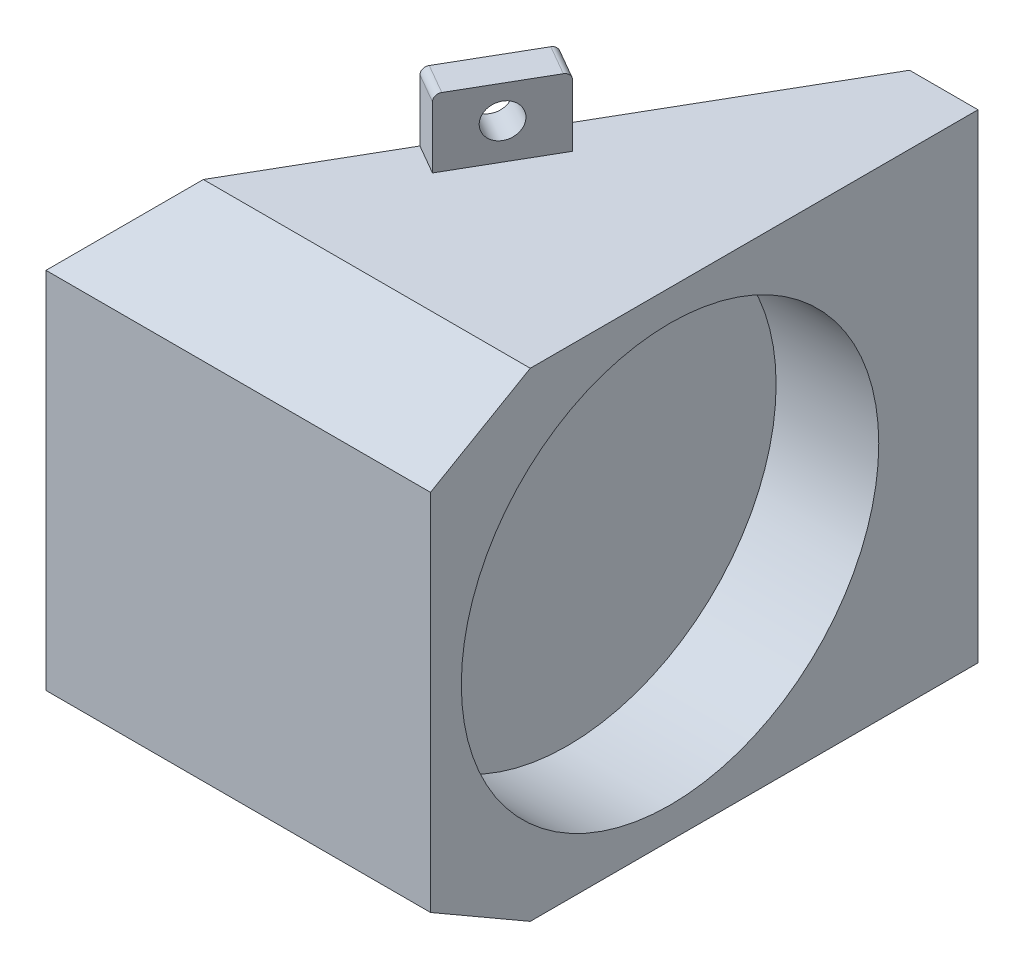
ISO-10303-21;
HEADER;
FILE_DESCRIPTION(('STEP AP214'),'2;1');
FILE_NAME('part.step','',(''),(''),'','','');
FILE_SCHEMA(('AUTOMOTIVE_DESIGN { 1 0 10303 214 1 1 1 1 }'));
ENDSEC;
DATA;
#1=APPLICATION_CONTEXT('core data for automotive mechanical design processes');
#2=APPLICATION_PROTOCOL_DEFINITION('international standard','automotive_design',2000,#1);
#3=PRODUCT_CONTEXT('',#1,'mechanical');
#4=PRODUCT('Part','Part','',(#3));
#5=PRODUCT_RELATED_PRODUCT_CATEGORY('part','',(#4));
#6=PRODUCT_DEFINITION_FORMATION('','',#4);
#7=PRODUCT_DEFINITION_CONTEXT('part definition',#1,'design');
#8=PRODUCT_DEFINITION('design','',#6,#7);
#9=PRODUCT_DEFINITION_SHAPE('','',#8);
#10=(LENGTH_UNIT() NAMED_UNIT(*) SI_UNIT(.MILLI.,.METRE.));
#11=(NAMED_UNIT(*) PLANE_ANGLE_UNIT() SI_UNIT($,.RADIAN.));
#12=(NAMED_UNIT(*) SI_UNIT($,.STERADIAN.) SOLID_ANGLE_UNIT());
#13=UNCERTAINTY_MEASURE_WITH_UNIT(LENGTH_MEASURE(1.E-05),#10,'distance_accuracy_value','');
#14=(GEOMETRIC_REPRESENTATION_CONTEXT(3) GLOBAL_UNCERTAINTY_ASSIGNED_CONTEXT((#13)) GLOBAL_UNIT_ASSIGNED_CONTEXT((#10,
#11,#12)) REPRESENTATION_CONTEXT('',''));
#15=CARTESIAN_POINT('',(0.,0.,0.));
#16=DIRECTION('',(0.,0.,1.));
#17=DIRECTION('',(1.,0.,0.));
#18=AXIS2_PLACEMENT_3D('',#15,#16,#17);
#19=CARTESIAN_POINT('',(0.,0.,0.));
#20=DIRECTION('',(0.,1.,0.));
#21=DIRECTION('',(0.,0.,1.));
#22=AXIS2_PLACEMENT_3D('',#19,#20,#21);
#23=PLANE('',#22);
#24=DIRECTION('',(0.,0.,-1.));
#25=VECTOR('',#24,1.);
#26=CARTESIAN_POINT('',(12.7,0.,0.));
#27=LINE('',#26,#25);
#28=CARTESIAN_POINT('',(12.7,0.,-18.5091607941304));
#29=VERTEX_POINT('',#28);
#30=CARTESIAN_POINT('',(12.7,0.,-101.6));
#31=VERTEX_POINT('',#30);
#32=EDGE_CURVE('E273',#29,#31,#27,.T.);
#33=ORIENTED_EDGE('',*,*,#32,.F.);
#34=DIRECTION('',(1.,0.,0.));
#35=VECTOR('',#34,1.);
#36=CARTESIAN_POINT('',(-58.6587873496651,0.,-18.5091607941304));
#37=LINE('',#36,#35);
#38=CARTESIAN_POINT('',(-47.9725183827,0.,-18.5091607941304));
#39=VERTEX_POINT('',#38);
#40=EDGE_CURVE('E398',#39,#29,#37,.T.);
#41=ORIENTED_EDGE('',*,*,#40,.F.);
#42=DIRECTION('',(-0.499999999999995,0.,0.866025403784442));
#43=VECTOR('',#42,1.);
#44=CARTESIAN_POINT('',(0.,0.,-101.6));
#45=LINE('',#44,#43);
#46=CARTESIAN_POINT('',(-32.7225854253355,0.,-44.9228194883053));
#47=VERTEX_POINT('',#46);
#48=EDGE_CURVE('E288',#47,#39,#45,.T.);
#49=ORIENTED_EDGE('',*,*,#48,.F.);
#50=DIRECTION('',(-0.866025403784439,0.,-0.5));
#51=VECTOR('',#50,1.);
#52=CARTESIAN_POINT('',(-32.7225854253355,0.,-44.9228194883053));
#53=LINE('',#52,#51);
#54=CARTESIAN_POINT('',(-27.2233241113047,0.,-41.7478194883055));
#55=VERTEX_POINT('',#54);
#56=EDGE_CURVE('E251',#55,#47,#53,.T.);
#57=ORIENTED_EDGE('',*,*,#56,.F.);
#58=DIRECTION('',(-0.5,0.,0.866025403784438));
#59=VECTOR('',#58,1.);
#60=CARTESIAN_POINT('',(-27.2233241113047,0.,-41.7478194883055));
#61=LINE('',#60,#59);
#62=CARTESIAN_POINT('',(-17.6983241113047,0.,-58.245603430399));
#63=VERTEX_POINT('',#62);
#64=EDGE_CURVE('E255',#63,#55,#61,.T.);
#65=ORIENTED_EDGE('',*,*,#64,.F.);
#66=DIRECTION('',(0.86602540378444,0.,0.499999999999998));
#67=VECTOR('',#66,1.);
#68=CARTESIAN_POINT('',(-17.6983241113047,0.,-58.245603430399));
#69=LINE('',#68,#67);
#70=CARTESIAN_POINT('',(-23.1975854253356,0.,-61.4206034303989));
#71=VERTEX_POINT('',#70);
#72=EDGE_CURVE('E261',#71,#63,#69,.T.);
#73=ORIENTED_EDGE('',*,*,#72,.F.);
#74=CARTESIAN_POINT('',(0.,0.,-101.6));
#75=VERTEX_POINT('',#74);
#76=EDGE_CURVE('E186',#75,#71,#45,.T.);
#77=ORIENTED_EDGE('',*,*,#76,.F.);
#78=DIRECTION('',(-1.,0.,0.));
#79=VECTOR('',#78,1.);
#80=CARTESIAN_POINT('',(12.7,0.,-101.6));
#81=LINE('',#80,#79);
#82=EDGE_CURVE('E283',#31,#75,#81,.T.);
#83=ORIENTED_EDGE('',*,*,#82,.F.);
#84=EDGE_LOOP('',(#33,#41,#49,#57,#65,#73,#77,#83));
#85=FACE_BOUND('',#84,.T.);
#86=ADVANCED_FACE('F37',(#85),#23,.F.);
#87=CARTESIAN_POINT('',(-6.35,44.45,-44.45));
#88=DIRECTION('',(1.,0.,0.));
#89=DIRECTION('',(0.,0.,-1.));
#90=AXIS2_PLACEMENT_3D('',#87,#88,#89);
#91=CYLINDRICAL_SURFACE('',#90,38.735);
#92=CARTESIAN_POINT('',(-6.35,44.45,-44.45));
#93=DIRECTION('',(1.,0.,0.));
#94=DIRECTION('',(0.,0.,-1.));
#95=AXIS2_PLACEMENT_3D('',#92,#93,#94);
#96=CIRCLE('',#95,38.735);
#97=CARTESIAN_POINT('',(-6.35,44.45,-83.185));
#98=VERTEX_POINT('',#97);
#99=EDGE_CURVE('E286',#98,#98,#96,.T.);
#100=ORIENTED_EDGE('',*,*,#99,.F.);
#101=EDGE_LOOP('',(#100));
#102=FACE_BOUND('',#101,.T.);
#103=CARTESIAN_POINT('',(12.7,44.45,-44.45));
#104=DIRECTION('',(1.,0.,0.));
#105=DIRECTION('',(0.,0.,-1.));
#106=AXIS2_PLACEMENT_3D('',#103,#104,#105);
#107=CIRCLE('',#106,38.735);
#108=CARTESIAN_POINT('',(12.7,44.45,-83.185));
#109=VERTEX_POINT('',#108);
#110=EDGE_CURVE('E269',#109,#109,#107,.T.);
#111=ORIENTED_EDGE('',*,*,#110,.T.);
#112=EDGE_LOOP('',(#111));
#113=FACE_BOUND('',#112,.T.);
#114=ADVANCED_FACE('F359',(#102,#113),#91,.F.);
#115=CARTESIAN_POINT('',(-6.35,44.45,-44.45));
#116=DIRECTION('',(1.,0.,0.));
#117=DIRECTION('',(0.,0.,-1.));
#118=AXIS2_PLACEMENT_3D('',#115,#116,#117);
#119=PLANE('',#118);
#120=ORIENTED_EDGE('',*,*,#99,.T.);
#121=EDGE_LOOP('',(#120));
#122=FACE_BOUND('',#121,.T.);
#123=ADVANCED_FACE('F367',(#122),#119,.T.);
#124=CARTESIAN_POINT('',(12.7,0.,0.));
#125=DIRECTION('',(1.,0.,0.));
#126=DIRECTION('',(0.,0.,-1.));
#127=AXIS2_PLACEMENT_3D('',#124,#125,#126);
#128=PLANE('',#127);
#129=DIRECTION('',(0.,0.499999999999995,-0.866025403784442));
#130=VECTOR('',#129,1.);
#131=CARTESIAN_POINT('',(12.7,88.9,-18.5091607941304));
#132=LINE('',#131,#130);
#133=CARTESIAN_POINT('',(12.7,78.2137310330349,0.));
#134=VERTEX_POINT('',#133);
#135=CARTESIAN_POINT('',(12.7,88.9,-18.5091607941304));
#136=VERTEX_POINT('',#135);
#137=EDGE_CURVE('E173',#134,#136,#132,.T.);
#138=ORIENTED_EDGE('',*,*,#137,.F.);
#139=DIRECTION('',(0.,-1.,0.));
#140=VECTOR('',#139,1.);
#141=CARTESIAN_POINT('',(12.7,88.9,0.));
#142=LINE('',#141,#140);
#143=CARTESIAN_POINT('',(12.7,10.6862689669651,0.));
#144=VERTEX_POINT('',#143);
#145=EDGE_CURVE('E172',#134,#144,#142,.T.);
#146=ORIENTED_EDGE('',*,*,#145,.T.);
#147=DIRECTION('',(0.,0.499999999999995,0.866025403784442));
#148=VECTOR('',#147,1.);
#149=CARTESIAN_POINT('',(12.7,0.,-18.5091607941304));
#150=LINE('',#149,#148);
#151=EDGE_CURVE('E402',#29,#144,#150,.T.);
#152=ORIENTED_EDGE('',*,*,#151,.F.);
#153=ORIENTED_EDGE('',*,*,#32,.T.);
#154=DIRECTION('',(0.,1.,0.));
#155=VECTOR('',#154,1.);
#156=CARTESIAN_POINT('',(12.7,0.,-101.6));
#157=LINE('',#156,#155);
#158=CARTESIAN_POINT('',(12.7,88.9,-101.6));
#159=VERTEX_POINT('',#158);
#160=EDGE_CURVE('E275',#31,#159,#157,.T.);
#161=ORIENTED_EDGE('',*,*,#160,.T.);
#162=DIRECTION('',(0.,0.,1.));
#163=VECTOR('',#162,1.);
#164=CARTESIAN_POINT('',(12.7,88.9,-101.6));
#165=LINE('',#164,#163);
#166=EDGE_CURVE('E277',#159,#136,#165,.T.);
#167=ORIENTED_EDGE('',*,*,#166,.T.);
#168=EDGE_LOOP('',(#138,#146,#152,#153,#161,#167));
#169=FACE_BOUND('',#168,.T.);
#170=ORIENTED_EDGE('',*,*,#110,.F.);
#171=EDGE_LOOP('',(#170));
#172=FACE_BOUND('',#171,.T.);
#173=ADVANCED_FACE('F561',(#169,#172),#128,.T.);
#174=CARTESIAN_POINT('',(12.7,0.,-101.6));
#175=DIRECTION('',(0.,0.,1.));
#176=DIRECTION('',(1.,0.,0.));
#177=AXIS2_PLACEMENT_3D('',#174,#175,#176);
#178=PLANE('',#177);
#179=DIRECTION('',(0.,-1.,0.));
#180=VECTOR('',#179,1.);
#181=CARTESIAN_POINT('',(0.,88.9,-101.6));
#182=LINE('',#181,#180);
#183=CARTESIAN_POINT('',(0.,88.9,-101.6));
#184=VERTEX_POINT('',#183);
#185=EDGE_CURVE('E177',#184,#75,#182,.T.);
#186=ORIENTED_EDGE('',*,*,#185,.F.);
#187=DIRECTION('',(-1.,0.,0.));
#188=VECTOR('',#187,1.);
#189=CARTESIAN_POINT('',(12.7,88.9,-101.6));
#190=LINE('',#189,#188);
#191=EDGE_CURVE('E280',#159,#184,#190,.T.);
#192=ORIENTED_EDGE('',*,*,#191,.F.);
#193=ORIENTED_EDGE('',*,*,#160,.F.);
#194=ORIENTED_EDGE('',*,*,#82,.T.);
#195=EDGE_LOOP('',(#186,#192,#193,#194));
#196=FACE_BOUND('',#195,.T.);
#197=ADVANCED_FACE('F378',(#196),#178,.F.);
#198=CARTESIAN_POINT('',(-58.6587873496651,88.9,0.));
#199=DIRECTION('',(0.,0.,-1.));
#200=DIRECTION('',(-1.,0.,0.));
#201=AXIS2_PLACEMENT_3D('',#198,#199,#200);
#202=PLANE('',#201);
#203=ORIENTED_EDGE('',*,*,#145,.F.);
#204=DIRECTION('',(1.,0.,0.));
#205=VECTOR('',#204,1.);
#206=CARTESIAN_POINT('',(-58.6587873496651,78.2137310330349,0.));
#207=LINE('',#206,#205);
#208=CARTESIAN_POINT('',(-58.6587873496651,78.2137310330349,0.));
#209=VERTEX_POINT('',#208);
#210=EDGE_CURVE('E160',#209,#134,#207,.T.);
#211=ORIENTED_EDGE('',*,*,#210,.F.);
#212=DIRECTION('',(0.,-1.,0.));
#213=VECTOR('',#212,1.);
#214=CARTESIAN_POINT('',(-58.6587873496651,88.9,0.));
#215=LINE('',#214,#213);
#216=CARTESIAN_POINT('',(-58.6587873496651,10.6862689669651,0.));
#217=VERTEX_POINT('',#216);
#218=EDGE_CURVE('E170',#209,#217,#215,.T.);
#219=ORIENTED_EDGE('',*,*,#218,.T.);
#220=DIRECTION('',(1.,0.,0.));
#221=VECTOR('',#220,1.);
#222=CARTESIAN_POINT('',(-58.6587873496651,10.6862689669651,0.));
#223=LINE('',#222,#221);
#224=EDGE_CURVE('E59',#217,#144,#223,.T.);
#225=ORIENTED_EDGE('',*,*,#224,.T.);
#226=EDGE_LOOP('',(#203,#211,#219,#225));
#227=FACE_BOUND('',#226,.T.);
#228=ADVANCED_FACE('F169',(#227),#202,.F.);
#229=CARTESIAN_POINT('',(0.,88.9,0.));
#230=DIRECTION('',(0.,1.,0.));
#231=DIRECTION('',(0.,0.,1.));
#232=AXIS2_PLACEMENT_3D('',#229,#230,#231);
#233=PLANE('',#232);
#234=DIRECTION('',(1.,0.,0.));
#235=VECTOR('',#234,1.);
#236=CARTESIAN_POINT('',(-58.6587873496651,88.9,-18.5091607941304));
#237=LINE('',#236,#235);
#238=CARTESIAN_POINT('',(-47.9725183827,88.9,-18.5091607941304));
#239=VERTEX_POINT('',#238);
#240=EDGE_CURVE('E52',#239,#136,#237,.T.);
#241=ORIENTED_EDGE('',*,*,#240,.T.);
#242=ORIENTED_EDGE('',*,*,#166,.F.);
#243=ORIENTED_EDGE('',*,*,#191,.T.);
#244=DIRECTION('',(-0.499999999999995,0.,0.866025403784442));
#245=VECTOR('',#244,1.);
#246=CARTESIAN_POINT('',(0.,88.9,-101.6));
#247=LINE('',#246,#245);
#248=CARTESIAN_POINT('',(-23.7337873496655,88.9,-60.4918744543433));
#249=VERTEX_POINT('',#248);
#250=EDGE_CURVE('E178',#184,#249,#247,.T.);
#251=ORIENTED_EDGE('',*,*,#250,.T.);
#252=DIRECTION('',(-0.866025403784438,0.,-0.500000000000001));
#253=VECTOR('',#252,1.);
#254=CARTESIAN_POINT('',(-23.7337873496658,88.9,-60.4918744543434));
#255=LINE('',#254,#253);
#256=CARTESIAN_POINT('',(-18.2345260356346,88.9,-57.3168744543434));
#257=VERTEX_POINT('',#256);
#258=EDGE_CURVE('E328',#257,#249,#255,.T.);
#259=ORIENTED_EDGE('',*,*,#258,.F.);
#260=DIRECTION('',(0.5,0.,-0.866025403784439));
#261=VECTOR('',#260,1.);
#262=CARTESIAN_POINT('',(-18.2345260356346,88.9,-57.3168744543434));
#263=LINE('',#262,#261);
#264=CARTESIAN_POINT('',(-27.7595260356346,88.9,-40.8190905122498));
#265=VERTEX_POINT('',#264);
#266=EDGE_CURVE('E333',#265,#257,#263,.T.);
#267=ORIENTED_EDGE('',*,*,#266,.F.);
#268=DIRECTION('',(0.866025403784439,0.,0.499999999999999));
#269=VECTOR('',#268,1.);
#270=CARTESIAN_POINT('',(-27.7595260356346,88.9,-40.8190905122498));
#271=LINE('',#270,#269);
#272=CARTESIAN_POINT('',(-33.2587873496654,88.9,-43.9940905122496));
#273=VERTEX_POINT('',#272);
#274=EDGE_CURVE('E298',#273,#265,#271,.T.);
#275=ORIENTED_EDGE('',*,*,#274,.F.);
#276=EDGE_CURVE('E183',#273,#239,#247,.T.);
#277=ORIENTED_EDGE('',*,*,#276,.T.);
#278=EDGE_LOOP('',(#241,#242,#243,#251,#259,#267,#275,#277));
#279=FACE_BOUND('',#278,.T.);
#280=ADVANCED_FACE('F294',(#279),#233,.T.);
#281=CARTESIAN_POINT('',(0.,88.9,-101.6));
#282=DIRECTION('',(0.866025403784442,0.,0.499999999999995));
#283=DIRECTION('',(0.499999999999995,0.,-0.866025403784442));
#284=AXIS2_PLACEMENT_3D('',#281,#282,#283);
#285=PLANE('',#284);
#286=CARTESIAN_POINT('',(-28.4962873496655,95.5413595918628,-52.2429824832964));
#287=DIRECTION('',(0.866025403784442,0.,0.499999999999995));
#288=DIRECTION('',(0.499999999999995,0.,-0.866025403784442));
#289=AXIS2_PLACEMENT_3D('',#286,#287,#288);
#290=CIRCLE('',#289,3.17499999999999);
#291=CARTESIAN_POINT('',(-26.9087873496655,95.5413595918628,-54.992613140312));
#292=VERTEX_POINT('',#291);
#293=EDGE_CURVE('E334',#292,#292,#290,.T.);
#294=ORIENTED_EDGE('',*,*,#293,.T.);
#295=EDGE_LOOP('',(#294));
#296=FACE_BOUND('',#295,.T.);
#297=CARTESIAN_POINT('',(-27.9600854253356,-6.46367915976498,-53.1717114593521));
#298=DIRECTION('',(0.866025403784442,0.,0.499999999999995));
#299=DIRECTION('',(0.499999999999995,0.,-0.866025403784442));
#300=AXIS2_PLACEMENT_3D('',#297,#298,#299);
#301=CIRCLE('',#300,3.17499999999999);
#302=CARTESIAN_POINT('',(-26.3725854253356,-6.46367915976498,-55.9213421163676));
#303=VERTEX_POINT('',#302);
#304=EDGE_CURVE('E258',#303,#303,#301,.T.);
#305=ORIENTED_EDGE('',*,*,#304,.T.);
#306=EDGE_LOOP('',(#305));
#307=FACE_BOUND('',#306,.T.);
#308=ORIENTED_EDGE('',*,*,#218,.F.);
#309=DIRECTION('',(0.447213595499954,0.447213595499954,-0.774596669241488));
#310=VECTOR('',#309,1.);
#311=CARTESIAN_POINT('',(-9.59450367653985,127.27801470616,-84.9818321588264));
#312=LINE('',#311,#310);
#313=EDGE_CURVE('E11',#209,#239,#312,.T.);
#314=ORIENTED_EDGE('',*,*,#313,.T.);
#315=ORIENTED_EDGE('',*,*,#276,.F.);
#316=DIRECTION('',(0.,-1.,0.));
#317=VECTOR('',#316,1.);
#318=CARTESIAN_POINT('',(-33.2587873496658,101.6,-43.9940905122498));
#319=LINE('',#318,#317);
#320=CARTESIAN_POINT('',(-33.2587873496658,100.33,-43.9940905122498));
#321=VERTEX_POINT('',#320);
#322=EDGE_CURVE('E300',#321,#273,#319,.T.);
#323=ORIENTED_EDGE('',*,*,#322,.F.);
#324=CARTESIAN_POINT('',(-32.6237873496654,100.33,-45.0939427750559));
#325=DIRECTION('',(0.866025403784442,0.,0.499999999999995));
#326=DIRECTION('',(0.499999999999995,0.,-0.866025403784442));
#327=AXIS2_PLACEMENT_3D('',#324,#325,#326);
#328=CIRCLE('',#327,1.27);
#329=CARTESIAN_POINT('',(-32.6237873496658,101.6,-45.0939427750561));
#330=VERTEX_POINT('',#329);
#331=EDGE_CURVE('E205',#321,#330,#328,.F.);
#332=ORIENTED_EDGE('',*,*,#331,.T.);
#333=DIRECTION('',(-0.5,0.,0.866025403784439));
#334=VECTOR('',#333,1.);
#335=CARTESIAN_POINT('',(-33.2587873496658,101.6,-43.9940905122498));
#336=LINE('',#335,#334);
#337=CARTESIAN_POINT('',(-24.3687873496658,101.6,-59.3920221915372));
#338=VERTEX_POINT('',#337);
#339=EDGE_CURVE('E318',#338,#330,#336,.T.);
#340=ORIENTED_EDGE('',*,*,#339,.F.);
#341=CARTESIAN_POINT('',(-24.3687873496655,100.33,-59.392022191537));
#342=DIRECTION('',(0.866025403784442,0.,0.499999999999995));
#343=DIRECTION('',(0.499999999999995,0.,-0.866025403784442));
#344=AXIS2_PLACEMENT_3D('',#341,#342,#343);
#345=CIRCLE('',#344,1.27);
#346=CARTESIAN_POINT('',(-23.7337873496658,100.33,-60.4918744543434));
#347=VERTEX_POINT('',#346);
#348=EDGE_CURVE('E203',#338,#347,#345,.F.);
#349=ORIENTED_EDGE('',*,*,#348,.T.);
#350=DIRECTION('',(0.,-1.,0.));
#351=VECTOR('',#350,1.);
#352=CARTESIAN_POINT('',(-23.7337873496658,101.6,-60.4918744543434));
#353=LINE('',#352,#351);
#354=EDGE_CURVE('E324',#347,#249,#353,.T.);
#355=ORIENTED_EDGE('',*,*,#354,.T.);
#356=ORIENTED_EDGE('',*,*,#250,.F.);
#357=ORIENTED_EDGE('',*,*,#185,.T.);
#358=ORIENTED_EDGE('',*,*,#76,.T.);
#359=DIRECTION('',(0.,1.,0.));
#360=VECTOR('',#359,1.);
#361=CARTESIAN_POINT('',(-23.1975854253359,-12.7,-61.420603430399));
#362=LINE('',#361,#360);
#363=CARTESIAN_POINT('',(-23.1975854253359,-11.43,-61.420603430399));
#364=VERTEX_POINT('',#363);
#365=EDGE_CURVE('E228',#364,#71,#362,.T.);
#366=ORIENTED_EDGE('',*,*,#365,.F.);
#367=CARTESIAN_POINT('',(-23.8325854253356,-11.43,-60.3207511675926));
#368=DIRECTION('',(0.866025403784442,0.,0.499999999999995));
#369=DIRECTION('',(0.499999999999995,0.,-0.866025403784442));
#370=AXIS2_PLACEMENT_3D('',#367,#368,#369);
#371=CIRCLE('',#370,1.27);
#372=CARTESIAN_POINT('',(-23.8325854253358,-12.7,-60.3207511675928));
#373=VERTEX_POINT('',#372);
#374=EDGE_CURVE('E199',#364,#373,#371,.F.);
#375=ORIENTED_EDGE('',*,*,#374,.T.);
#376=DIRECTION('',(0.499999999999982,0.,-0.866025403784449));
#377=VECTOR('',#376,1.);
#378=CARTESIAN_POINT('',(-23.1975854253359,-12.7,-61.420603430399));
#379=LINE('',#378,#377);
#380=CARTESIAN_POINT('',(-32.0875854253355,-12.7,-46.0226717511115));
#381=VERTEX_POINT('',#380);
#382=EDGE_CURVE('E238',#381,#373,#379,.T.);
#383=ORIENTED_EDGE('',*,*,#382,.F.);
#384=CARTESIAN_POINT('',(-32.0875854253355,-11.43,-46.0226717511115));
#385=DIRECTION('',(0.866025403784442,0.,0.499999999999995));
#386=DIRECTION('',(0.499999999999995,0.,-0.866025403784442));
#387=AXIS2_PLACEMENT_3D('',#384,#385,#386);
#388=CIRCLE('',#387,1.27);
#389=CARTESIAN_POINT('',(-32.7225854253355,-11.43,-44.9228194883053));
#390=VERTEX_POINT('',#389);
#391=EDGE_CURVE('E201',#381,#390,#388,.F.);
#392=ORIENTED_EDGE('',*,*,#391,.T.);
#393=DIRECTION('',(0.,1.,0.));
#394=VECTOR('',#393,1.);
#395=CARTESIAN_POINT('',(-32.7225854253355,-12.7,-44.9228194883053));
#396=LINE('',#395,#394);
#397=EDGE_CURVE('E237',#390,#47,#396,.T.);
#398=ORIENTED_EDGE('',*,*,#397,.T.);
#399=ORIENTED_EDGE('',*,*,#48,.T.);
#400=DIRECTION('',(-0.447213595499954,0.447213595499954,0.774596669241488));
#401=VECTOR('',#400,1.);
#402=CARTESIAN_POINT('',(-27.3745036765395,-20.5980147061605,-54.1859688002518));
#403=LINE('',#402,#401);
#404=EDGE_CURVE('E45',#39,#217,#403,.T.);
#405=ORIENTED_EDGE('',*,*,#404,.T.);
#406=EDGE_LOOP('',(#308,#314,#315,#323,#332,#340,#349,#355,#356,#357,#358,#366,#375,#383,#392,
#398,#399,#405));
#407=FACE_BOUND('',#406,.T.);
#408=ADVANCED_FACE('F175',(#296,#307,#407),#285,.F.);
#409=CARTESIAN_POINT('',(-17.6983241113047,-12.7,-58.245603430399));
#410=DIRECTION('',(-0.499999999999998,0.,0.86602540378444));
#411=DIRECTION('',(0.86602540378444,0.,0.499999999999998));
#412=AXIS2_PLACEMENT_3D('',#409,#410,#411);
#413=PLANE('',#412);
#414=DIRECTION('',(0.,1.,0.));
#415=VECTOR('',#414,1.);
#416=CARTESIAN_POINT('',(-17.6983241113047,-12.7,-58.245603430399));
#417=LINE('',#416,#415);
#418=CARTESIAN_POINT('',(-17.6983241113047,-11.43,-58.245603430399));
#419=VERTEX_POINT('',#418);
#420=EDGE_CURVE('E230',#419,#63,#417,.T.);
#421=ORIENTED_EDGE('',*,*,#420,.F.);
#422=DIRECTION('',(0.86602540378444,0.,0.499999999999998));
#423=VECTOR('',#422,1.);
#424=CARTESIAN_POINT('',(-17.6983241113047,-11.43,-58.245603430399));
#425=LINE('',#424,#423);
#426=EDGE_CURVE('E221',#419,#364,#425,.F.);
#427=ORIENTED_EDGE('',*,*,#426,.T.);
#428=ORIENTED_EDGE('',*,*,#365,.T.);
#429=ORIENTED_EDGE('',*,*,#72,.T.);
#430=EDGE_LOOP('',(#421,#427,#428,#429));
#431=FACE_BOUND('',#430,.T.);
#432=ADVANCED_FACE('F226',(#431),#413,.F.);
#433=CARTESIAN_POINT('',(-27.2233241113047,-12.7,-41.7478194883055));
#434=DIRECTION('',(-0.866025403784438,0.,-0.5));
#435=DIRECTION('',(-0.5,0.,0.866025403784438));
#436=AXIS2_PLACEMENT_3D('',#433,#434,#435);
#437=PLANE('',#436);
#438=CARTESIAN_POINT('',(-22.4608241113047,-6.46367915976498,-49.9967114593522));
#439=DIRECTION('',(0.866025403784438,0.,0.5));
#440=DIRECTION('',(0.5,0.,-0.866025403784439));
#441=AXIS2_PLACEMENT_3D('',#438,#439,#440);
#442=CIRCLE('',#441,3.17499999999999);
#443=CARTESIAN_POINT('',(-20.8733241113047,-6.46367915976498,-52.7463421163678));
#444=VERTEX_POINT('',#443);
#445=EDGE_CURVE('E305',#444,#444,#442,.T.);
#446=ORIENTED_EDGE('',*,*,#445,.F.);
#447=EDGE_LOOP('',(#446));
#448=FACE_BOUND('',#447,.T.);
#449=DIRECTION('',(0.,1.,0.));
#450=VECTOR('',#449,1.);
#451=CARTESIAN_POINT('',(-27.2233241113047,-12.7,-41.7478194883055));
#452=LINE('',#451,#450);
#453=CARTESIAN_POINT('',(-27.2233241113047,-11.43,-41.7478194883055));
#454=VERTEX_POINT('',#453);
#455=EDGE_CURVE('E266',#454,#55,#452,.T.);
#456=ORIENTED_EDGE('',*,*,#455,.F.);
#457=CARTESIAN_POINT('',(-26.5883241113047,-11.43,-42.8476717511117));
#458=DIRECTION('',(-0.866025403784438,0.,-0.5));
#459=DIRECTION('',(-0.5,0.,0.866025403784438));
#460=AXIS2_PLACEMENT_3D('',#457,#458,#459);
#461=CIRCLE('',#460,1.27);
#462=CARTESIAN_POINT('',(-26.5883241113047,-12.7,-42.8476717511117));
#463=VERTEX_POINT('',#462);
#464=EDGE_CURVE('E219',#454,#463,#461,.F.);
#465=ORIENTED_EDGE('',*,*,#464,.T.);
#466=DIRECTION('',(-0.5,0.,0.866025403784438));
#467=VECTOR('',#466,1.);
#468=CARTESIAN_POINT('',(-27.2233241113047,-12.7,-41.7478194883055));
#469=LINE('',#468,#467);
#470=CARTESIAN_POINT('',(-18.3333241113047,-12.7,-57.1457511675928));
#471=VERTEX_POINT('',#470);
#472=EDGE_CURVE('E245',#471,#463,#469,.T.);
#473=ORIENTED_EDGE('',*,*,#472,.F.);
#474=CARTESIAN_POINT('',(-18.3333241113047,-11.43,-57.1457511675928));
#475=DIRECTION('',(-0.866025403784438,0.,-0.5));
#476=DIRECTION('',(-0.5,0.,0.866025403784438));
#477=AXIS2_PLACEMENT_3D('',#474,#475,#476);
#478=CIRCLE('',#477,1.27);
#479=EDGE_CURVE('E217',#471,#419,#478,.F.);
#480=ORIENTED_EDGE('',*,*,#479,.T.);
#481=ORIENTED_EDGE('',*,*,#420,.T.);
#482=ORIENTED_EDGE('',*,*,#64,.T.);
#483=EDGE_LOOP('',(#456,#465,#473,#480,#481,#482));
#484=FACE_BOUND('',#483,.T.);
#485=ADVANCED_FACE('F249',(#448,#484),#437,.F.);
#486=CARTESIAN_POINT('',(-32.7225854253355,-12.7,-44.9228194883053));
#487=DIRECTION('',(0.5,0.,-0.866025403784438));
#488=DIRECTION('',(-0.866025403784439,0.,-0.5));
#489=AXIS2_PLACEMENT_3D('',#486,#487,#488);
#490=PLANE('',#489);
#491=ORIENTED_EDGE('',*,*,#397,.F.);
#492=DIRECTION('',(-0.866025403784439,0.,-0.5));
#493=VECTOR('',#492,1.);
#494=CARTESIAN_POINT('',(-32.7225854253355,-11.43,-44.9228194883053));
#495=LINE('',#494,#493);
#496=EDGE_CURVE('E215',#390,#454,#495,.F.);
#497=ORIENTED_EDGE('',*,*,#496,.T.);
#498=ORIENTED_EDGE('',*,*,#455,.T.);
#499=ORIENTED_EDGE('',*,*,#56,.T.);
#500=EDGE_LOOP('',(#491,#497,#498,#499));
#501=FACE_BOUND('',#500,.T.);
#502=ADVANCED_FACE('F356',(#501),#490,.F.);
#503=CARTESIAN_POINT('',(0.,-12.7,0.));
#504=DIRECTION('',(0.,1.,0.));
#505=DIRECTION('',(0.,0.,1.));
#506=AXIS2_PLACEMENT_3D('',#503,#504,#505);
#507=PLANE('',#506);
#508=ORIENTED_EDGE('',*,*,#472,.T.);
#509=DIRECTION('',(-0.866025403784439,0.,-0.5));
#510=VECTOR('',#509,1.);
#511=CARTESIAN_POINT('',(11.9065050869136,-12.7,-20.6226717511117));
#512=LINE('',#511,#510);
#513=EDGE_CURVE('E212',#463,#381,#512,.T.);
#514=ORIENTED_EDGE('',*,*,#513,.T.);
#515=ORIENTED_EDGE('',*,*,#382,.T.);
#516=DIRECTION('',(0.86602540378444,0.,0.499999999999998));
#517=VECTOR('',#516,1.);
#518=CARTESIAN_POINT('',(20.1615050869136,-12.7,-34.9207511675929));
#519=LINE('',#518,#517);
#520=EDGE_CURVE('E209',#373,#471,#519,.T.);
#521=ORIENTED_EDGE('',*,*,#520,.T.);
#522=EDGE_LOOP('',(#508,#514,#515,#521));
#523=FACE_BOUND('',#522,.T.);
#524=ADVANCED_FACE('F244',(#523),#507,.F.);
#525=CARTESIAN_POINT('',(-71.9541759375847,-6.46367915976498,-78.5717114593519));
#526=DIRECTION('',(0.866025403784438,0.,0.5));
#527=DIRECTION('',(0.5,0.,-0.866025403784439));
#528=AXIS2_PLACEMENT_3D('',#525,#526,#527);
#529=CYLINDRICAL_SURFACE('',#528,3.17499999999999);
#530=ORIENTED_EDGE('',*,*,#445,.T.);
#531=EDGE_LOOP('',(#530));
#532=FACE_BOUND('',#531,.T.);
#533=ORIENTED_EDGE('',*,*,#304,.F.);
#534=EDGE_LOOP('',(#533));
#535=FACE_BOUND('',#534,.T.);
#536=ADVANCED_FACE('F347',(#532,#535),#529,.F.);
#537=CARTESIAN_POINT('',(-27.7595260356346,101.6,-40.8190905122498));
#538=DIRECTION('',(0.499999999999999,0.,-0.866025403784439));
#539=DIRECTION('',(-0.866025403784439,0.,-0.499999999999999));
#540=AXIS2_PLACEMENT_3D('',#537,#538,#539);
#541=PLANE('',#540);
#542=DIRECTION('',(0.,-1.,0.));
#543=VECTOR('',#542,1.);
#544=CARTESIAN_POINT('',(-27.7595260356346,101.6,-40.8190905122498));
#545=LINE('',#544,#543);
#546=CARTESIAN_POINT('',(-27.7595260356346,100.33,-40.8190905122498));
#547=VERTEX_POINT('',#546);
#548=EDGE_CURVE('E306',#547,#265,#545,.T.);
#549=ORIENTED_EDGE('',*,*,#548,.F.);
#550=DIRECTION('',(0.866025403784439,0.,0.499999999999999));
#551=VECTOR('',#550,1.);
#552=CARTESIAN_POINT('',(-27.7595260356346,100.33,-40.8190905122498));
#553=LINE('',#552,#551);
#554=EDGE_CURVE('E197',#547,#321,#553,.F.);
#555=ORIENTED_EDGE('',*,*,#554,.T.);
#556=ORIENTED_EDGE('',*,*,#322,.T.);
#557=ORIENTED_EDGE('',*,*,#274,.T.);
#558=EDGE_LOOP('',(#549,#555,#556,#557));
#559=FACE_BOUND('',#558,.T.);
#560=ADVANCED_FACE('F349',(#559),#541,.F.);
#561=CARTESIAN_POINT('',(-18.2345260356346,101.6,-57.3168744543434));
#562=DIRECTION('',(-0.866025403784439,0.,-0.5));
#563=DIRECTION('',(-0.5,0.,0.866025403784439));
#564=AXIS2_PLACEMENT_3D('',#561,#562,#563);
#565=PLANE('',#564);
#566=CARTESIAN_POINT('',(-22.9970260356346,95.5413595918628,-49.0679824832966));
#567=DIRECTION('',(0.866025403784439,0.,0.5));
#568=DIRECTION('',(0.5,0.,-0.866025403784439));
#569=AXIS2_PLACEMENT_3D('',#566,#567,#568);
#570=CIRCLE('',#569,3.17499999999999);
#571=CARTESIAN_POINT('',(-21.4095260356346,95.5413595918628,-51.8176131403122));
#572=VERTEX_POINT('',#571);
#573=EDGE_CURVE('E406',#572,#572,#570,.T.);
#574=ORIENTED_EDGE('',*,*,#573,.F.);
#575=EDGE_LOOP('',(#574));
#576=FACE_BOUND('',#575,.T.);
#577=DIRECTION('',(0.5,0.,-0.866025403784439));
#578=VECTOR('',#577,1.);
#579=CARTESIAN_POINT('',(-18.2345260356346,101.6,-57.3168744543434));
#580=LINE('',#579,#578);
#581=CARTESIAN_POINT('',(-27.1245260356346,101.6,-41.9189427750561));
#582=VERTEX_POINT('',#581);
#583=CARTESIAN_POINT('',(-18.8695260356346,101.6,-56.2170221915372));
#584=VERTEX_POINT('',#583);
#585=EDGE_CURVE('E316',#582,#584,#580,.T.);
#586=ORIENTED_EDGE('',*,*,#585,.F.);
#587=CARTESIAN_POINT('',(-27.1245260356346,100.33,-41.9189427750561));
#588=DIRECTION('',(-0.866025403784439,0.,-0.5));
#589=DIRECTION('',(-0.5,0.,0.866025403784439));
#590=AXIS2_PLACEMENT_3D('',#587,#588,#589);
#591=CIRCLE('',#590,1.27);
#592=EDGE_CURVE('E195',#582,#547,#591,.F.);
#593=ORIENTED_EDGE('',*,*,#592,.T.);
#594=ORIENTED_EDGE('',*,*,#548,.T.);
#595=ORIENTED_EDGE('',*,*,#266,.T.);
#596=DIRECTION('',(0.,-1.,0.));
#597=VECTOR('',#596,1.);
#598=CARTESIAN_POINT('',(-18.2345260356346,101.6,-57.3168744543434));
#599=LINE('',#598,#597);
#600=CARTESIAN_POINT('',(-18.2345260356346,100.33,-57.3168744543434));
#601=VERTEX_POINT('',#600);
#602=EDGE_CURVE('E326',#601,#257,#599,.T.);
#603=ORIENTED_EDGE('',*,*,#602,.F.);
#604=CARTESIAN_POINT('',(-18.8695260356346,100.33,-56.2170221915372));
#605=DIRECTION('',(-0.866025403784439,0.,-0.5));
#606=DIRECTION('',(-0.5,0.,0.866025403784439));
#607=AXIS2_PLACEMENT_3D('',#604,#605,#606);
#608=CIRCLE('',#607,1.27);
#609=EDGE_CURVE('E193',#601,#584,#608,.F.);
#610=ORIENTED_EDGE('',*,*,#609,.T.);
#611=EDGE_LOOP('',(#586,#593,#594,#595,#603,#610));
#612=FACE_BOUND('',#611,.T.);
#613=ADVANCED_FACE('F320',(#576,#612),#565,.F.);
#614=CARTESIAN_POINT('',(-23.7337873496658,101.6,-60.4918744543434));
#615=DIRECTION('',(-0.500000000000001,0.,0.866025403784438));
#616=DIRECTION('',(0.866025403784438,0.,0.500000000000001));
#617=AXIS2_PLACEMENT_3D('',#614,#615,#616);
#618=PLANE('',#617);
#619=ORIENTED_EDGE('',*,*,#354,.F.);
#620=DIRECTION('',(-0.866025403784438,0.,-0.500000000000001));
#621=VECTOR('',#620,1.);
#622=CARTESIAN_POINT('',(-23.7337873496658,100.33,-60.4918744543434));
#623=LINE('',#622,#621);
#624=EDGE_CURVE('E207',#347,#601,#623,.F.);
#625=ORIENTED_EDGE('',*,*,#624,.T.);
#626=ORIENTED_EDGE('',*,*,#602,.T.);
#627=ORIENTED_EDGE('',*,*,#258,.T.);
#628=EDGE_LOOP('',(#619,#625,#626,#627));
#629=FACE_BOUND('',#628,.T.);
#630=ADVANCED_FACE('F417',(#629),#618,.F.);
#631=CARTESIAN_POINT('',(0.,101.6,0.));
#632=DIRECTION('',(0.,-1.,0.));
#633=DIRECTION('',(0.,0.,-1.));
#634=AXIS2_PLACEMENT_3D('',#631,#632,#633);
#635=PLANE('',#634);
#636=ORIENTED_EDGE('',*,*,#339,.T.);
#637=DIRECTION('',(0.866025403784439,0.,0.499999999999999));
#638=VECTOR('',#637,1.);
#639=CARTESIAN_POINT('',(11.3703031625837,101.6,-19.6939427750561));
#640=LINE('',#639,#638);
#641=EDGE_CURVE('E190',#330,#582,#640,.T.);
#642=ORIENTED_EDGE('',*,*,#641,.T.);
#643=ORIENTED_EDGE('',*,*,#585,.T.);
#644=DIRECTION('',(-0.866025403784438,0.,-0.500000000000001));
#645=VECTOR('',#644,1.);
#646=CARTESIAN_POINT('',(19.6253031625837,101.6,-33.9920221915371));
#647=LINE('',#646,#645);
#648=EDGE_CURVE('E180',#584,#338,#647,.T.);
#649=ORIENTED_EDGE('',*,*,#648,.T.);
#650=EDGE_LOOP('',(#636,#642,#643,#649));
#651=FACE_BOUND('',#650,.T.);
#652=ADVANCED_FACE('F315',(#651),#635,.F.);
#653=CARTESIAN_POINT('',(-72.4903778619146,95.5413595918628,-77.6429824832962));
#654=DIRECTION('',(0.866025403784439,0.,0.5));
#655=DIRECTION('',(0.5,0.,-0.866025403784439));
#656=AXIS2_PLACEMENT_3D('',#653,#654,#655);
#657=CYLINDRICAL_SURFACE('',#656,3.17499999999999);
#658=ORIENTED_EDGE('',*,*,#573,.T.);
#659=EDGE_LOOP('',(#658));
#660=FACE_BOUND('',#659,.T.);
#661=ORIENTED_EDGE('',*,*,#293,.F.);
#662=EDGE_LOOP('',(#661));
#663=FACE_BOUND('',#662,.T.);
#664=ADVANCED_FACE('F382',(#660,#663),#657,.F.);
#665=CARTESIAN_POINT('',(11.3703031625837,100.33,-19.6939427750561));
#666=DIRECTION('',(0.866025403784439,0.,0.499999999999999));
#667=DIRECTION('',(0.499999999999999,0.,-0.866025403784439));
#668=AXIS2_PLACEMENT_3D('',#665,#666,#667);
#669=CYLINDRICAL_SURFACE('',#668,1.27);
#670=ORIENTED_EDGE('',*,*,#331,.F.);
#671=ORIENTED_EDGE('',*,*,#554,.F.);
#672=ORIENTED_EDGE('',*,*,#592,.F.);
#673=ORIENTED_EDGE('',*,*,#641,.F.);
#674=EDGE_LOOP('',(#670,#671,#672,#673));
#675=FACE_BOUND('',#674,.T.);
#676=ADVANCED_FACE('F311',(#675),#669,.T.);
#677=CARTESIAN_POINT('',(19.6253031625837,100.33,-33.9920221915371));
#678=DIRECTION('',(-0.866025403784438,0.,-0.500000000000001));
#679=DIRECTION('',(-0.500000000000001,0.,0.866025403784438));
#680=AXIS2_PLACEMENT_3D('',#677,#678,#679);
#681=CYLINDRICAL_SURFACE('',#680,1.27);
#682=ORIENTED_EDGE('',*,*,#609,.F.);
#683=ORIENTED_EDGE('',*,*,#624,.F.);
#684=ORIENTED_EDGE('',*,*,#348,.F.);
#685=ORIENTED_EDGE('',*,*,#648,.F.);
#686=EDGE_LOOP('',(#682,#683,#684,#685));
#687=FACE_BOUND('',#686,.T.);
#688=ADVANCED_FACE('F381',(#687),#681,.T.);
#689=CARTESIAN_POINT('',(11.9065050869136,-11.43,-20.6226717511117));
#690=DIRECTION('',(-0.866025403784439,0.,-0.5));
#691=DIRECTION('',(-0.5,0.,0.866025403784439));
#692=AXIS2_PLACEMENT_3D('',#689,#690,#691);
#693=CYLINDRICAL_SURFACE('',#692,1.27);
#694=ORIENTED_EDGE('',*,*,#464,.F.);
#695=ORIENTED_EDGE('',*,*,#496,.F.);
#696=ORIENTED_EDGE('',*,*,#391,.F.);
#697=ORIENTED_EDGE('',*,*,#513,.F.);
#698=EDGE_LOOP('',(#694,#695,#696,#697));
#699=FACE_BOUND('',#698,.T.);
#700=ADVANCED_FACE('F384',(#699),#693,.T.);
#701=CARTESIAN_POINT('',(20.1615050869136,-11.43,-34.9207511675929));
#702=DIRECTION('',(0.86602540378444,0.,0.499999999999998));
#703=DIRECTION('',(0.499999999999998,0.,-0.86602540378444));
#704=AXIS2_PLACEMENT_3D('',#701,#702,#703);
#705=CYLINDRICAL_SURFACE('',#704,1.27);
#706=ORIENTED_EDGE('',*,*,#374,.F.);
#707=ORIENTED_EDGE('',*,*,#426,.F.);
#708=ORIENTED_EDGE('',*,*,#479,.F.);
#709=ORIENTED_EDGE('',*,*,#520,.F.);
#710=EDGE_LOOP('',(#706,#707,#708,#709));
#711=FACE_BOUND('',#710,.T.);
#712=ADVANCED_FACE('F39',(#711),#705,.T.);
#713=CARTESIAN_POINT('',(-58.6587873496651,0.,-18.5091607941304));
#714=DIRECTION('',(0.,0.866025403784442,-0.499999999999995));
#715=DIRECTION('',(0.,0.499999999999995,0.866025403784442));
#716=AXIS2_PLACEMENT_3D('',#713,#714,#715);
#717=PLANE('',#716);
#718=ORIENTED_EDGE('',*,*,#40,.T.);
#719=ORIENTED_EDGE('',*,*,#151,.T.);
#720=ORIENTED_EDGE('',*,*,#224,.F.);
#721=ORIENTED_EDGE('',*,*,#404,.F.);
#722=EDGE_LOOP('',(#718,#719,#720,#721));
#723=FACE_BOUND('',#722,.T.);
#724=ADVANCED_FACE('F391',(#723),#717,.F.);
#725=CARTESIAN_POINT('',(-58.6587873496651,88.9,-18.5091607941304));
#726=DIRECTION('',(0.,-0.866025403784442,-0.499999999999995));
#727=DIRECTION('',(0.,0.499999999999995,-0.866025403784442));
#728=AXIS2_PLACEMENT_3D('',#725,#726,#727);
#729=PLANE('',#728);
#730=ORIENTED_EDGE('',*,*,#210,.T.);
#731=ORIENTED_EDGE('',*,*,#137,.T.);
#732=ORIENTED_EDGE('',*,*,#240,.F.);
#733=ORIENTED_EDGE('',*,*,#313,.F.);
#734=EDGE_LOOP('',(#730,#731,#732,#733));
#735=FACE_BOUND('',#734,.T.);
#736=ADVANCED_FACE('F159',(#735),#729,.F.);
#737=CLOSED_SHELL('',(#86,#114,#123,#173,#197,#228,#280,#408,#432,#485,#502,#524,#536,#560,#613,
#630,#652,#664,#676,#688,#700,#712,#724,#736));
#738=MANIFOLD_SOLID_BREP('B2',#737);
#739=ADVANCED_BREP_SHAPE_REPRESENTATION('',(#18,#738),#14);
#740=SHAPE_DEFINITION_REPRESENTATION(#9,#739);
ENDSEC;
END-ISO-10303-21;
